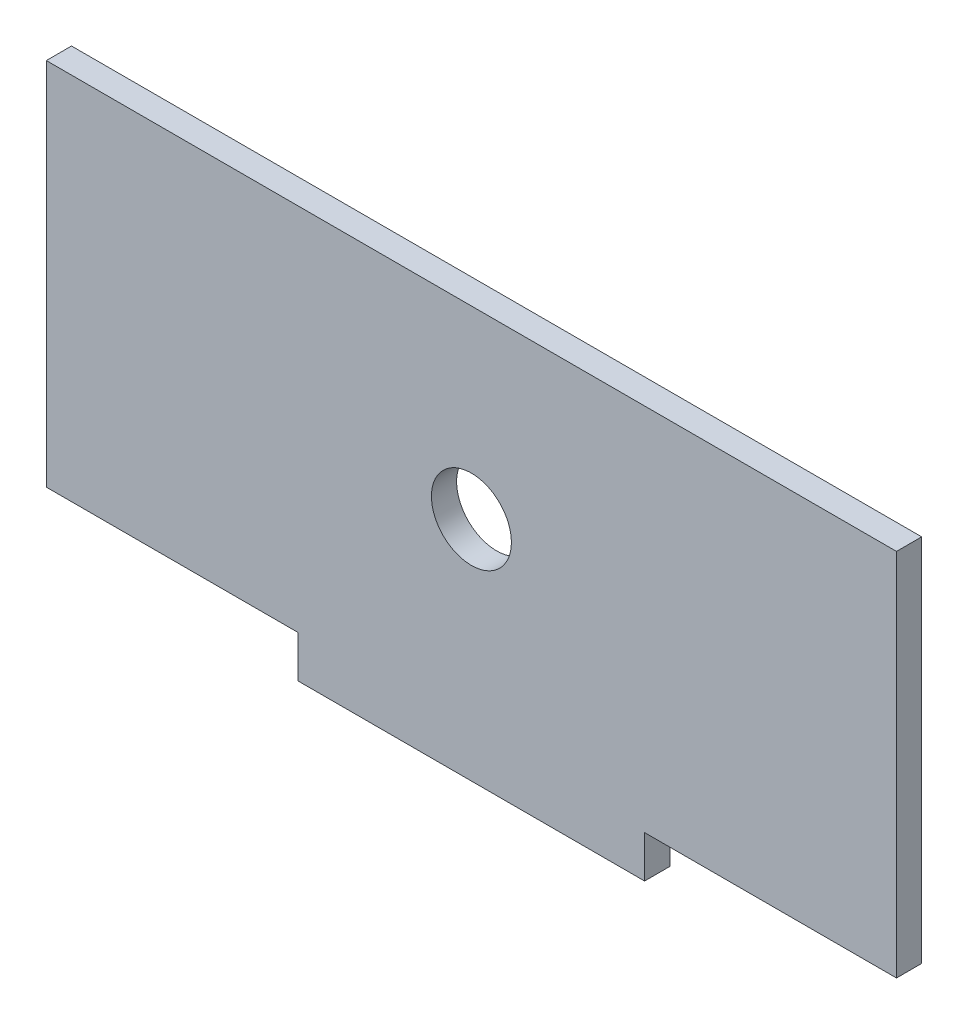
ISO-10303-21;
HEADER;
FILE_DESCRIPTION(('STEP AP214'),'2;1');
FILE_NAME('part.step','',(''),(''),'','','');
FILE_SCHEMA(('AUTOMOTIVE_DESIGN { 1 0 10303 214 1 1 1 1 }'));
ENDSEC;
DATA;
#1=APPLICATION_CONTEXT('core data for automotive mechanical design processes');
#2=APPLICATION_PROTOCOL_DEFINITION('international standard','automotive_design',2000,#1);
#3=PRODUCT_CONTEXT('',#1,'mechanical');
#4=PRODUCT('Part','Part','',(#3));
#5=PRODUCT_RELATED_PRODUCT_CATEGORY('part','',(#4));
#6=PRODUCT_DEFINITION_FORMATION('','',#4);
#7=PRODUCT_DEFINITION_CONTEXT('part definition',#1,'design');
#8=PRODUCT_DEFINITION('design','',#6,#7);
#9=PRODUCT_DEFINITION_SHAPE('','',#8);
#10=(LENGTH_UNIT() NAMED_UNIT(*) SI_UNIT(.MILLI.,.METRE.));
#11=(NAMED_UNIT(*) PLANE_ANGLE_UNIT() SI_UNIT($,.RADIAN.));
#12=(NAMED_UNIT(*) SI_UNIT($,.STERADIAN.) SOLID_ANGLE_UNIT());
#13=UNCERTAINTY_MEASURE_WITH_UNIT(LENGTH_MEASURE(1.E-05),#10,'distance_accuracy_value','');
#14=(GEOMETRIC_REPRESENTATION_CONTEXT(3) GLOBAL_UNCERTAINTY_ASSIGNED_CONTEXT((#13)) GLOBAL_UNIT_ASSIGNED_CONTEXT((#10,
#11,#12)) REPRESENTATION_CONTEXT('',''));
#15=CARTESIAN_POINT('',(0.,0.,0.));
#16=DIRECTION('',(0.,0.,1.));
#17=DIRECTION('',(1.,0.,0.));
#18=AXIS2_PLACEMENT_3D('',#15,#16,#17);
#19=CARTESIAN_POINT('',(50.625,0.,3.));
#20=DIRECTION('',(0.,-1.,0.));
#21=DIRECTION('',(1.,0.,0.));
#22=AXIS2_PLACEMENT_3D('',#19,#20,#21);
#23=PLANE('',#22);
#24=DIRECTION('',(-1.,0.,0.));
#25=VECTOR('',#24,1.);
#26=CARTESIAN_POINT('',(50.625,0.,0.));
#27=LINE('',#26,#25);
#28=CARTESIAN_POINT('',(50.625,0.,0.));
#29=VERTEX_POINT('',#28);
#30=CARTESIAN_POINT('',(-50.625,0.,0.));
#31=VERTEX_POINT('',#30);
#32=EDGE_CURVE('E141',#29,#31,#27,.T.);
#33=ORIENTED_EDGE('',*,*,#32,.T.);
#34=DIRECTION('',(0.,0.,-1.));
#35=VECTOR('',#34,1.);
#36=CARTESIAN_POINT('',(-50.625,0.,3.));
#37=LINE('',#36,#35);
#38=CARTESIAN_POINT('',(-50.625,0.,3.));
#39=VERTEX_POINT('',#38);
#40=EDGE_CURVE('E11',#39,#31,#37,.T.);
#41=ORIENTED_EDGE('',*,*,#40,.F.);
#42=DIRECTION('',(-1.,0.,0.));
#43=VECTOR('',#42,1.);
#44=CARTESIAN_POINT('',(50.625,0.,3.));
#45=LINE('',#44,#43);
#46=CARTESIAN_POINT('',(50.625,0.,3.));
#47=VERTEX_POINT('',#46);
#48=EDGE_CURVE('E164',#47,#39,#45,.T.);
#49=ORIENTED_EDGE('',*,*,#48,.F.);
#50=DIRECTION('',(0.,0.,-1.));
#51=VECTOR('',#50,1.);
#52=CARTESIAN_POINT('',(50.625,0.,3.));
#53=LINE('',#52,#51);
#54=EDGE_CURVE('E137',#47,#29,#53,.T.);
#55=ORIENTED_EDGE('',*,*,#54,.T.);
#56=EDGE_LOOP('',(#33,#41,#49,#55));
#57=FACE_BOUND('',#56,.T.);
#58=ADVANCED_FACE('F39',(#57),#23,.F.);
#59=CARTESIAN_POINT('',(-50.625,0.,3.));
#60=DIRECTION('',(1.,0.,0.));
#61=DIRECTION('',(0.,0.,-1.));
#62=AXIS2_PLACEMENT_3D('',#59,#60,#61);
#63=PLANE('',#62);
#64=DIRECTION('',(0.,-1.,0.));
#65=VECTOR('',#64,1.);
#66=CARTESIAN_POINT('',(-50.625,0.,0.));
#67=LINE('',#66,#65);
#68=CARTESIAN_POINT('',(-50.625,-44.,0.));
#69=VERTEX_POINT('',#68);
#70=EDGE_CURVE('E145',#31,#69,#67,.T.);
#71=ORIENTED_EDGE('',*,*,#70,.T.);
#72=DIRECTION('',(0.,0.,-1.));
#73=VECTOR('',#72,1.);
#74=CARTESIAN_POINT('',(-50.625,-44.,3.));
#75=LINE('',#74,#73);
#76=CARTESIAN_POINT('',(-50.625,-44.,3.));
#77=VERTEX_POINT('',#76);
#78=EDGE_CURVE('E48',#77,#69,#75,.T.);
#79=ORIENTED_EDGE('',*,*,#78,.F.);
#80=DIRECTION('',(0.,-1.,0.));
#81=VECTOR('',#80,1.);
#82=CARTESIAN_POINT('',(-50.625,0.,3.));
#83=LINE('',#82,#81);
#84=EDGE_CURVE('E99',#39,#77,#83,.T.);
#85=ORIENTED_EDGE('',*,*,#84,.F.);
#86=ORIENTED_EDGE('',*,*,#40,.T.);
#87=EDGE_LOOP('',(#71,#79,#85,#86));
#88=FACE_BOUND('',#87,.T.);
#89=ADVANCED_FACE('F233',(#88),#63,.F.);
#90=CARTESIAN_POINT('',(-50.625,-44.,3.));
#91=DIRECTION('',(0.,1.,0.));
#92=DIRECTION('',(0.,0.,1.));
#93=AXIS2_PLACEMENT_3D('',#90,#91,#92);
#94=PLANE('',#93);
#95=DIRECTION('',(1.,0.,0.));
#96=VECTOR('',#95,1.);
#97=CARTESIAN_POINT('',(-50.625,-44.,0.));
#98=LINE('',#97,#96);
#99=CARTESIAN_POINT('',(-20.625,-44.,0.));
#100=VERTEX_POINT('',#99);
#101=EDGE_CURVE('E149',#69,#100,#98,.T.);
#102=ORIENTED_EDGE('',*,*,#101,.T.);
#103=DIRECTION('',(0.,0.,-1.));
#104=VECTOR('',#103,1.);
#105=CARTESIAN_POINT('',(-20.625,-44.,3.));
#106=LINE('',#105,#104);
#107=CARTESIAN_POINT('',(-20.625,-44.,3.));
#108=VERTEX_POINT('',#107);
#109=EDGE_CURVE('E175',#108,#100,#106,.T.);
#110=ORIENTED_EDGE('',*,*,#109,.F.);
#111=DIRECTION('',(1.,0.,0.));
#112=VECTOR('',#111,1.);
#113=CARTESIAN_POINT('',(-50.625,-44.,3.));
#114=LINE('',#113,#112);
#115=EDGE_CURVE('E186',#77,#108,#114,.T.);
#116=ORIENTED_EDGE('',*,*,#115,.F.);
#117=ORIENTED_EDGE('',*,*,#78,.T.);
#118=EDGE_LOOP('',(#102,#110,#116,#117));
#119=FACE_BOUND('',#118,.T.);
#120=ADVANCED_FACE('F184',(#119),#94,.F.);
#121=CARTESIAN_POINT('',(-20.625,-44.,3.));
#122=DIRECTION('',(1.,0.,0.));
#123=DIRECTION('',(0.,0.,-1.));
#124=AXIS2_PLACEMENT_3D('',#121,#122,#123);
#125=PLANE('',#124);
#126=DIRECTION('',(0.,-1.,0.));
#127=VECTOR('',#126,1.);
#128=CARTESIAN_POINT('',(-20.625,-44.,0.));
#129=LINE('',#128,#127);
#130=CARTESIAN_POINT('',(-20.625,-49.,0.));
#131=VERTEX_POINT('',#130);
#132=EDGE_CURVE('E152',#100,#131,#129,.T.);
#133=ORIENTED_EDGE('',*,*,#132,.T.);
#134=DIRECTION('',(0.,0.,-1.));
#135=VECTOR('',#134,1.);
#136=CARTESIAN_POINT('',(-20.625,-49.,3.));
#137=LINE('',#136,#135);
#138=CARTESIAN_POINT('',(-20.625,-49.,3.));
#139=VERTEX_POINT('',#138);
#140=EDGE_CURVE('E171',#139,#131,#137,.T.);
#141=ORIENTED_EDGE('',*,*,#140,.F.);
#142=DIRECTION('',(0.,-1.,0.));
#143=VECTOR('',#142,1.);
#144=CARTESIAN_POINT('',(-20.625,-44.,3.));
#145=LINE('',#144,#143);
#146=EDGE_CURVE('E199',#108,#139,#145,.T.);
#147=ORIENTED_EDGE('',*,*,#146,.F.);
#148=ORIENTED_EDGE('',*,*,#109,.T.);
#149=EDGE_LOOP('',(#133,#141,#147,#148));
#150=FACE_BOUND('',#149,.T.);
#151=ADVANCED_FACE('F194',(#150),#125,.F.);
#152=CARTESIAN_POINT('',(-20.625,-49.,3.));
#153=DIRECTION('',(0.,1.,0.));
#154=DIRECTION('',(-1.,0.,0.));
#155=AXIS2_PLACEMENT_3D('',#152,#153,#154);
#156=PLANE('',#155);
#157=DIRECTION('',(1.,0.,0.));
#158=VECTOR('',#157,1.);
#159=CARTESIAN_POINT('',(-20.625,-49.,0.));
#160=LINE('',#159,#158);
#161=CARTESIAN_POINT('',(20.625,-49.,0.));
#162=VERTEX_POINT('',#161);
#163=EDGE_CURVE('E155',#131,#162,#160,.T.);
#164=ORIENTED_EDGE('',*,*,#163,.T.);
#165=DIRECTION('',(0.,0.,-1.));
#166=VECTOR('',#165,1.);
#167=CARTESIAN_POINT('',(20.625,-49.,3.));
#168=LINE('',#167,#166);
#169=CARTESIAN_POINT('',(20.625,-49.,3.));
#170=VERTEX_POINT('',#169);
#171=EDGE_CURVE('E129',#170,#162,#168,.T.);
#172=ORIENTED_EDGE('',*,*,#171,.F.);
#173=DIRECTION('',(1.,0.,0.));
#174=VECTOR('',#173,1.);
#175=CARTESIAN_POINT('',(-20.625,-49.,3.));
#176=LINE('',#175,#174);
#177=EDGE_CURVE('E118',#139,#170,#176,.T.);
#178=ORIENTED_EDGE('',*,*,#177,.F.);
#179=ORIENTED_EDGE('',*,*,#140,.T.);
#180=EDGE_LOOP('',(#164,#172,#178,#179));
#181=FACE_BOUND('',#180,.T.);
#182=ADVANCED_FACE('F197',(#181),#156,.F.);
#183=CARTESIAN_POINT('',(20.625,-49.,3.));
#184=DIRECTION('',(-1.,0.,0.));
#185=DIRECTION('',(0.,-1.,0.));
#186=AXIS2_PLACEMENT_3D('',#183,#184,#185);
#187=PLANE('',#186);
#188=DIRECTION('',(0.,1.,0.));
#189=VECTOR('',#188,1.);
#190=CARTESIAN_POINT('',(20.625,-49.,0.));
#191=LINE('',#190,#189);
#192=CARTESIAN_POINT('',(20.625,-44.,0.));
#193=VERTEX_POINT('',#192);
#194=EDGE_CURVE('E127',#162,#193,#191,.T.);
#195=ORIENTED_EDGE('',*,*,#194,.T.);
#196=DIRECTION('',(0.,0.,-1.));
#197=VECTOR('',#196,1.);
#198=CARTESIAN_POINT('',(20.625,-44.,3.));
#199=LINE('',#198,#197);
#200=CARTESIAN_POINT('',(20.625,-44.,3.));
#201=VERTEX_POINT('',#200);
#202=EDGE_CURVE('E124',#201,#193,#199,.T.);
#203=ORIENTED_EDGE('',*,*,#202,.F.);
#204=DIRECTION('',(0.,1.,0.));
#205=VECTOR('',#204,1.);
#206=CARTESIAN_POINT('',(20.625,-49.,3.));
#207=LINE('',#206,#205);
#208=EDGE_CURVE('E112',#170,#201,#207,.T.);
#209=ORIENTED_EDGE('',*,*,#208,.F.);
#210=ORIENTED_EDGE('',*,*,#171,.T.);
#211=EDGE_LOOP('',(#195,#203,#209,#210));
#212=FACE_BOUND('',#211,.T.);
#213=ADVANCED_FACE('F125',(#212),#187,.F.);
#214=CARTESIAN_POINT('',(20.625,-44.,3.));
#215=DIRECTION('',(0.,1.,0.));
#216=DIRECTION('',(-1.,0.,0.));
#217=AXIS2_PLACEMENT_3D('',#214,#215,#216);
#218=PLANE('',#217);
#219=DIRECTION('',(1.,0.,0.));
#220=VECTOR('',#219,1.);
#221=CARTESIAN_POINT('',(20.625,-44.,0.));
#222=LINE('',#221,#220);
#223=CARTESIAN_POINT('',(50.625,-44.,0.));
#224=VERTEX_POINT('',#223);
#225=EDGE_CURVE('E85',#193,#224,#222,.T.);
#226=ORIENTED_EDGE('',*,*,#225,.T.);
#227=DIRECTION('',(0.,0.,-1.));
#228=VECTOR('',#227,1.);
#229=CARTESIAN_POINT('',(50.625,-44.,3.));
#230=LINE('',#229,#228);
#231=CARTESIAN_POINT('',(50.625,-44.,3.));
#232=VERTEX_POINT('',#231);
#233=EDGE_CURVE('E130',#232,#224,#230,.T.);
#234=ORIENTED_EDGE('',*,*,#233,.F.);
#235=DIRECTION('',(1.,0.,0.));
#236=VECTOR('',#235,1.);
#237=CARTESIAN_POINT('',(20.625,-44.,3.));
#238=LINE('',#237,#236);
#239=EDGE_CURVE('E116',#201,#232,#238,.T.);
#240=ORIENTED_EDGE('',*,*,#239,.F.);
#241=ORIENTED_EDGE('',*,*,#202,.T.);
#242=EDGE_LOOP('',(#226,#234,#240,#241));
#243=FACE_BOUND('',#242,.T.);
#244=ADVANCED_FACE('F132',(#243),#218,.F.);
#245=CARTESIAN_POINT('',(50.625,-44.,3.));
#246=DIRECTION('',(-1.,0.,0.));
#247=DIRECTION('',(0.,0.,1.));
#248=AXIS2_PLACEMENT_3D('',#245,#246,#247);
#249=PLANE('',#248);
#250=DIRECTION('',(0.,1.,0.));
#251=VECTOR('',#250,1.);
#252=CARTESIAN_POINT('',(50.625,-44.,0.));
#253=LINE('',#252,#251);
#254=EDGE_CURVE('E91',#224,#29,#253,.T.);
#255=ORIENTED_EDGE('',*,*,#254,.T.);
#256=ORIENTED_EDGE('',*,*,#54,.F.);
#257=DIRECTION('',(0.,1.,0.));
#258=VECTOR('',#257,1.);
#259=CARTESIAN_POINT('',(50.625,-44.,3.));
#260=LINE('',#259,#258);
#261=EDGE_CURVE('E56',#232,#47,#260,.T.);
#262=ORIENTED_EDGE('',*,*,#261,.F.);
#263=ORIENTED_EDGE('',*,*,#233,.T.);
#264=EDGE_LOOP('',(#255,#256,#262,#263));
#265=FACE_BOUND('',#264,.T.);
#266=ADVANCED_FACE('F222',(#265),#249,.F.);
#267=CARTESIAN_POINT('',(0.,0.,3.));
#268=DIRECTION('',(0.,0.,1.));
#269=DIRECTION('',(1.,0.,0.));
#270=AXIS2_PLACEMENT_3D('',#267,#268,#269);
#271=PLANE('',#270);
#272=CARTESIAN_POINT('',(0.,-22.,3.));
#273=DIRECTION('',(0.,0.,1.));
#274=DIRECTION('',(1.,0.,0.));
#275=AXIS2_PLACEMENT_3D('',#272,#273,#274);
#276=CIRCLE('',#275,4.7625);
#277=CARTESIAN_POINT('',(4.7625,-22.,3.));
#278=VERTEX_POINT('',#277);
#279=EDGE_CURVE('E213',#278,#278,#276,.T.);
#280=ORIENTED_EDGE('',*,*,#279,.F.);
#281=EDGE_LOOP('',(#280));
#282=FACE_BOUND('',#281,.T.);
#283=ORIENTED_EDGE('',*,*,#48,.T.);
#284=ORIENTED_EDGE('',*,*,#84,.T.);
#285=ORIENTED_EDGE('',*,*,#115,.T.);
#286=ORIENTED_EDGE('',*,*,#146,.T.);
#287=ORIENTED_EDGE('',*,*,#177,.T.);
#288=ORIENTED_EDGE('',*,*,#208,.T.);
#289=ORIENTED_EDGE('',*,*,#239,.T.);
#290=ORIENTED_EDGE('',*,*,#261,.T.);
#291=EDGE_LOOP('',(#283,#284,#285,#286,#287,#288,#289,#290));
#292=FACE_BOUND('',#291,.T.);
#293=ADVANCED_FACE('F114',(#282,#292),#271,.T.);
#294=CARTESIAN_POINT('',(0.,0.,0.));
#295=DIRECTION('',(0.,0.,1.));
#296=DIRECTION('',(1.,0.,0.));
#297=AXIS2_PLACEMENT_3D('',#294,#295,#296);
#298=PLANE('',#297);
#299=CARTESIAN_POINT('',(0.,-22.,0.));
#300=DIRECTION('',(0.,0.,1.));
#301=DIRECTION('',(1.,0.,0.));
#302=AXIS2_PLACEMENT_3D('',#299,#300,#301);
#303=CIRCLE('',#302,4.7625);
#304=CARTESIAN_POINT('',(4.7625,-22.,0.));
#305=VERTEX_POINT('',#304);
#306=EDGE_CURVE('E146',#305,#305,#303,.T.);
#307=ORIENTED_EDGE('',*,*,#306,.T.);
#308=EDGE_LOOP('',(#307));
#309=FACE_BOUND('',#308,.T.);
#310=ORIENTED_EDGE('',*,*,#32,.F.);
#311=ORIENTED_EDGE('',*,*,#254,.F.);
#312=ORIENTED_EDGE('',*,*,#225,.F.);
#313=ORIENTED_EDGE('',*,*,#194,.F.);
#314=ORIENTED_EDGE('',*,*,#163,.F.);
#315=ORIENTED_EDGE('',*,*,#132,.F.);
#316=ORIENTED_EDGE('',*,*,#101,.F.);
#317=ORIENTED_EDGE('',*,*,#70,.F.);
#318=EDGE_LOOP('',(#310,#311,#312,#313,#314,#315,#316,#317));
#319=FACE_BOUND('',#318,.T.);
#320=ADVANCED_FACE('F190',(#309,#319),#298,.F.);
#321=CARTESIAN_POINT('',(0.,-22.,3.));
#322=DIRECTION('',(0.,0.,1.));
#323=DIRECTION('',(1.,0.,0.));
#324=AXIS2_PLACEMENT_3D('',#321,#322,#323);
#325=CYLINDRICAL_SURFACE('',#324,4.7625);
#326=ORIENTED_EDGE('',*,*,#306,.F.);
#327=EDGE_LOOP('',(#326));
#328=FACE_BOUND('',#327,.T.);
#329=ORIENTED_EDGE('',*,*,#279,.T.);
#330=EDGE_LOOP('',(#329));
#331=FACE_BOUND('',#330,.T.);
#332=ADVANCED_FACE('F219',(#328,#331),#325,.F.);
#333=CLOSED_SHELL('',(#58,#89,#120,#151,#182,#213,#244,#266,#293,#320,#332));
#334=MANIFOLD_SOLID_BREP('B2',#333);
#335=ADVANCED_BREP_SHAPE_REPRESENTATION('',(#18,#334),#14);
#336=SHAPE_DEFINITION_REPRESENTATION(#9,#335);
ENDSEC;
END-ISO-10303-21;
